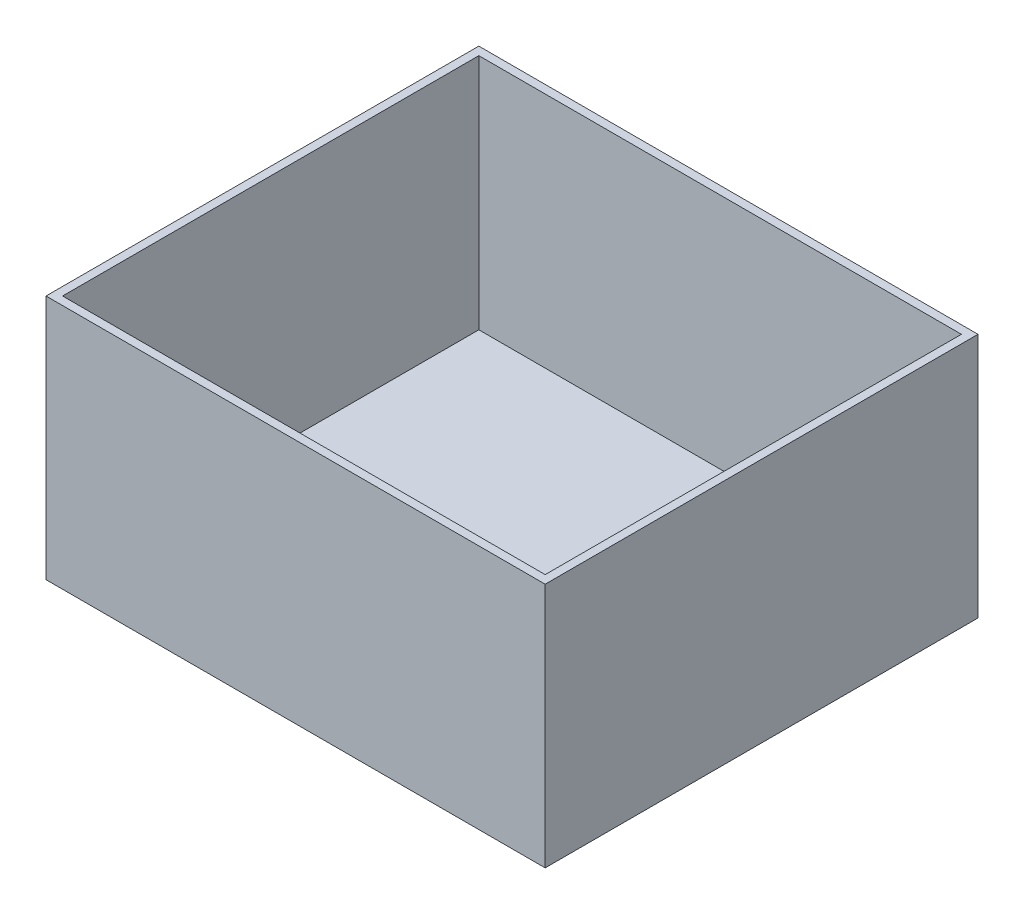
ISO-10303-21;
HEADER;
FILE_DESCRIPTION(('STEP AP214'),'2;1');
FILE_NAME('part.step','',(''),(''),'','','');
FILE_SCHEMA(('AUTOMOTIVE_DESIGN { 1 0 10303 214 1 1 1 1 }'));
ENDSEC;
DATA;
#1=APPLICATION_CONTEXT('core data for automotive mechanical design processes');
#2=APPLICATION_PROTOCOL_DEFINITION('international standard','automotive_design',2000,#1);
#3=PRODUCT_CONTEXT('',#1,'mechanical');
#4=PRODUCT('Part','Part','',(#3));
#5=PRODUCT_RELATED_PRODUCT_CATEGORY('part','',(#4));
#6=PRODUCT_DEFINITION_FORMATION('','',#4);
#7=PRODUCT_DEFINITION_CONTEXT('part definition',#1,'design');
#8=PRODUCT_DEFINITION('design','',#6,#7);
#9=PRODUCT_DEFINITION_SHAPE('','',#8);
#10=(LENGTH_UNIT() NAMED_UNIT(*) SI_UNIT(.MILLI.,.METRE.));
#11=(NAMED_UNIT(*) PLANE_ANGLE_UNIT() SI_UNIT($,.RADIAN.));
#12=(NAMED_UNIT(*) SI_UNIT($,.STERADIAN.) SOLID_ANGLE_UNIT());
#13=UNCERTAINTY_MEASURE_WITH_UNIT(LENGTH_MEASURE(1.E-05),#10,'distance_accuracy_value','');
#14=(GEOMETRIC_REPRESENTATION_CONTEXT(3) GLOBAL_UNCERTAINTY_ASSIGNED_CONTEXT((#13)) GLOBAL_UNIT_ASSIGNED_CONTEXT((#10,
#11,#12)) REPRESENTATION_CONTEXT('',''));
#15=CARTESIAN_POINT('',(0.,0.,0.));
#16=DIRECTION('',(0.,0.,1.));
#17=DIRECTION('',(1.,0.,0.));
#18=AXIS2_PLACEMENT_3D('',#15,#16,#17);
#19=CARTESIAN_POINT('',(157.177421254665,-270.823059497379,-47.6955186951065));
#20=DIRECTION('',(0.,0.,-1.));
#21=DIRECTION('',(0.,1.,0.));
#22=AXIS2_PLACEMENT_3D('',#19,#20,#21);
#23=PLANE('',#22);
#24=DIRECTION('',(0.,1.,0.));
#25=VECTOR('',#24,1.);
#26=CARTESIAN_POINT('',(157.177421254665,-270.823059497379,-47.6955186951065));
#27=LINE('',#26,#25);
#28=CARTESIAN_POINT('',(157.177421254665,-72.1234109033121,-47.6955186951057));
#29=VERTEX_POINT('',#28);
#30=CARTESIAN_POINT('',(157.177421254665,1.95658909668813,-47.6955186951055));
#31=VERTEX_POINT('',#30);
#32=EDGE_CURVE('E120',#29,#31,#27,.T.);
#33=ORIENTED_EDGE('',*,*,#32,.F.);
#34=DIRECTION('',(1.,0.,0.));
#35=VECTOR('',#34,1.);
#36=CARTESIAN_POINT('',(6.6774212546647,-72.1234109033121,-47.6955186951057));
#37=LINE('',#36,#35);
#38=CARTESIAN_POINT('',(6.6774212546647,-72.1234109033121,-47.6955186951057));
#39=VERTEX_POINT('',#38);
#40=EDGE_CURVE('E123',#39,#29,#37,.T.);
#41=ORIENTED_EDGE('',*,*,#40,.F.);
#42=DIRECTION('',(0.,1.,0.));
#43=VECTOR('',#42,1.);
#44=CARTESIAN_POINT('',(6.6774212546647,-270.823059497379,-47.6955186951064));
#45=LINE('',#44,#43);
#46=CARTESIAN_POINT('',(6.6774212546647,1.95658909668813,-47.6955186951055));
#47=VERTEX_POINT('',#46);
#48=EDGE_CURVE('E108',#39,#47,#45,.T.);
#49=ORIENTED_EDGE('',*,*,#48,.T.);
#50=DIRECTION('',(-1.,0.,0.));
#51=VECTOR('',#50,1.);
#52=CARTESIAN_POINT('',(157.177421254665,1.95658909668813,-47.6955186951055));
#53=LINE('',#52,#51);
#54=EDGE_CURVE('E176',#31,#47,#53,.T.);
#55=ORIENTED_EDGE('',*,*,#54,.F.);
#56=EDGE_LOOP('',(#33,#41,#49,#55));
#57=FACE_BOUND('',#56,.T.);
#58=ADVANCED_FACE('F39',(#57),#23,.T.);
#59=CARTESIAN_POINT('',(6.6774212546647,-270.823059497379,-47.6955186951064));
#60=DIRECTION('',(-1.,0.,0.));
#61=DIRECTION('',(0.,0.,1.));
#62=AXIS2_PLACEMENT_3D('',#59,#60,#61);
#63=PLANE('',#62);
#64=ORIENTED_EDGE('',*,*,#48,.F.);
#65=DIRECTION('',(0.,0.,-1.));
#66=VECTOR('',#65,1.);
#67=CARTESIAN_POINT('',(6.6774212546647,-72.1234109033121,-47.6955186951057));
#68=LINE('',#67,#66);
#69=CARTESIAN_POINT('',(6.6774212546647,-72.1234109033121,82.8044813048942));
#70=VERTEX_POINT('',#69);
#71=EDGE_CURVE('E112',#70,#39,#68,.T.);
#72=ORIENTED_EDGE('',*,*,#71,.F.);
#73=DIRECTION('',(0.,1.,0.));
#74=VECTOR('',#73,1.);
#75=CARTESIAN_POINT('',(6.67742125466471,-270.82305949738,82.8044813048935));
#76=LINE('',#75,#74);
#77=CARTESIAN_POINT('',(6.67742125466471,1.95658909668767,82.8044813048945));
#78=VERTEX_POINT('',#77);
#79=EDGE_CURVE('E119',#70,#78,#76,.T.);
#80=ORIENTED_EDGE('',*,*,#79,.T.);
#81=DIRECTION('',(0.,0.,1.));
#82=VECTOR('',#81,1.);
#83=CARTESIAN_POINT('',(6.6774212546647,1.95658909668813,-47.6955186951055));
#84=LINE('',#83,#82);
#85=EDGE_CURVE('E114',#47,#78,#84,.T.);
#86=ORIENTED_EDGE('',*,*,#85,.F.);
#87=EDGE_LOOP('',(#64,#72,#80,#86));
#88=FACE_BOUND('',#87,.T.);
#89=ADVANCED_FACE('F110',(#88),#63,.T.);
#90=CARTESIAN_POINT('',(6.67742125466471,-270.82305949738,82.8044813048935));
#91=DIRECTION('',(0.,0.,1.));
#92=DIRECTION('',(0.,-1.,0.));
#93=AXIS2_PLACEMENT_3D('',#90,#91,#92);
#94=PLANE('',#93);
#95=ORIENTED_EDGE('',*,*,#79,.F.);
#96=DIRECTION('',(-1.,0.,0.));
#97=VECTOR('',#96,1.);
#98=CARTESIAN_POINT('',(6.6774212546647,-72.1234109033121,82.8044813048942));
#99=LINE('',#98,#97);
#100=CARTESIAN_POINT('',(157.177421254665,-72.1234109033121,82.8044813048942));
#101=VERTEX_POINT('',#100);
#102=EDGE_CURVE('E133',#101,#70,#99,.T.);
#103=ORIENTED_EDGE('',*,*,#102,.F.);
#104=DIRECTION('',(0.,1.,0.));
#105=VECTOR('',#104,1.);
#106=CARTESIAN_POINT('',(157.177421254665,-270.82305949738,82.8044813048935));
#107=LINE('',#106,#105);
#108=CARTESIAN_POINT('',(157.177421254665,1.95658909668767,82.8044813048945));
#109=VERTEX_POINT('',#108);
#110=EDGE_CURVE('E185',#101,#109,#107,.T.);
#111=ORIENTED_EDGE('',*,*,#110,.T.);
#112=DIRECTION('',(1.,0.,0.));
#113=VECTOR('',#112,1.);
#114=CARTESIAN_POINT('',(6.67742125466471,1.95658909668767,82.8044813048945));
#115=LINE('',#114,#113);
#116=EDGE_CURVE('E181',#78,#109,#115,.T.);
#117=ORIENTED_EDGE('',*,*,#116,.F.);
#118=EDGE_LOOP('',(#95,#103,#111,#117));
#119=FACE_BOUND('',#118,.T.);
#120=ADVANCED_FACE('F196',(#119),#94,.T.);
#121=CARTESIAN_POINT('',(157.177421254665,-270.82305949738,82.8044813048935));
#122=DIRECTION('',(1.,0.,0.));
#123=DIRECTION('',(0.,0.,-1.));
#124=AXIS2_PLACEMENT_3D('',#121,#122,#123);
#125=PLANE('',#124);
#126=ORIENTED_EDGE('',*,*,#110,.F.);
#127=DIRECTION('',(0.,0.,1.));
#128=VECTOR('',#127,1.);
#129=CARTESIAN_POINT('',(157.177421254665,-72.1234109033121,-47.6955186951057));
#130=LINE('',#129,#128);
#131=EDGE_CURVE('E128',#29,#101,#130,.T.);
#132=ORIENTED_EDGE('',*,*,#131,.F.);
#133=ORIENTED_EDGE('',*,*,#32,.T.);
#134=DIRECTION('',(0.,0.,-1.));
#135=VECTOR('',#134,1.);
#136=CARTESIAN_POINT('',(157.177421254665,1.95658909668767,82.8044813048945));
#137=LINE('',#136,#135);
#138=EDGE_CURVE('E164',#109,#31,#137,.T.);
#139=ORIENTED_EDGE('',*,*,#138,.F.);
#140=EDGE_LOOP('',(#126,#132,#133,#139));
#141=FACE_BOUND('',#140,.T.);
#142=ADVANCED_FACE('F41',(#141),#125,.T.);
#143=CARTESIAN_POINT('',(0.,1.95658909668796,0.));
#144=DIRECTION('',(0.,1.,0.));
#145=DIRECTION('',(0.,0.,1.));
#146=AXIS2_PLACEMENT_3D('',#143,#144,#145);
#147=PLANE('',#146);
#148=DIRECTION('',(0.,0.,1.));
#149=VECTOR('',#148,1.);
#150=CARTESIAN_POINT('',(9.17742125466471,1.95658909668812,-45.1955186951055));
#151=LINE('',#150,#149);
#152=CARTESIAN_POINT('',(9.17742125466471,1.95658909668812,-45.1955186951055));
#153=VERTEX_POINT('',#152);
#154=CARTESIAN_POINT('',(9.17742125466471,1.95658909668768,80.3044813048945));
#155=VERTEX_POINT('',#154);
#156=EDGE_CURVE('E140',#153,#155,#151,.T.);
#157=ORIENTED_EDGE('',*,*,#156,.F.);
#158=DIRECTION('',(-1.,0.,0.));
#159=VECTOR('',#158,1.);
#160=CARTESIAN_POINT('',(154.677421254665,1.95658909668812,-45.1955186951055));
#161=LINE('',#160,#159);
#162=CARTESIAN_POINT('',(154.677421254665,1.95658909668812,-45.1955186951055));
#163=VERTEX_POINT('',#162);
#164=EDGE_CURVE('E157',#163,#153,#161,.T.);
#165=ORIENTED_EDGE('',*,*,#164,.F.);
#166=DIRECTION('',(0.,0.,-1.));
#167=VECTOR('',#166,1.);
#168=CARTESIAN_POINT('',(154.677421254665,1.95658909668768,80.3044813048945));
#169=LINE('',#168,#167);
#170=CARTESIAN_POINT('',(154.677421254665,1.95658909668768,80.3044813048945));
#171=VERTEX_POINT('',#170);
#172=EDGE_CURVE('E153',#171,#163,#169,.T.);
#173=ORIENTED_EDGE('',*,*,#172,.F.);
#174=DIRECTION('',(1.,0.,0.));
#175=VECTOR('',#174,1.);
#176=CARTESIAN_POINT('',(9.17742125466471,1.95658909668768,80.3044813048945));
#177=LINE('',#176,#175);
#178=EDGE_CURVE('E150',#155,#171,#177,.T.);
#179=ORIENTED_EDGE('',*,*,#178,.F.);
#180=EDGE_LOOP('',(#157,#165,#173,#179));
#181=FACE_BOUND('',#180,.T.);
#182=ORIENTED_EDGE('',*,*,#138,.T.);
#183=ORIENTED_EDGE('',*,*,#54,.T.);
#184=ORIENTED_EDGE('',*,*,#85,.T.);
#185=ORIENTED_EDGE('',*,*,#116,.T.);
#186=EDGE_LOOP('',(#182,#183,#184,#185));
#187=FACE_BOUND('',#186,.T.);
#188=ADVANCED_FACE('F193',(#181,#187),#147,.T.);
#189=CARTESIAN_POINT('',(9.17742125466471,-270.82305949738,80.3044813048935));
#190=DIRECTION('',(0.,0.,1.));
#191=DIRECTION('',(0.,-1.,0.));
#192=AXIS2_PLACEMENT_3D('',#189,#190,#191);
#193=PLANE('',#192);
#194=DIRECTION('',(0.,1.,0.));
#195=VECTOR('',#194,1.);
#196=CARTESIAN_POINT('',(154.677421254665,-270.82305949738,80.3044813048935));
#197=LINE('',#196,#195);
#198=CARTESIAN_POINT('',(154.677421254665,-69.6234109033121,80.3044813048942));
#199=VERTEX_POINT('',#198);
#200=EDGE_CURVE('E168',#199,#171,#197,.T.);
#201=ORIENTED_EDGE('',*,*,#200,.F.);
#202=DIRECTION('',(-1.,0.,0.));
#203=VECTOR('',#202,1.);
#204=CARTESIAN_POINT('',(9.17742125466471,-69.6234109033121,80.3044813048942));
#205=LINE('',#204,#203);
#206=CARTESIAN_POINT('',(9.17742125466471,-69.6234109033121,80.3044813048942));
#207=VERTEX_POINT('',#206);
#208=EDGE_CURVE('E43',#199,#207,#205,.T.);
#209=ORIENTED_EDGE('',*,*,#208,.T.);
#210=DIRECTION('',(0.,1.,0.));
#211=VECTOR('',#210,1.);
#212=CARTESIAN_POINT('',(9.17742125466471,-270.82305949738,80.3044813048935));
#213=LINE('',#212,#211);
#214=EDGE_CURVE('E64',#207,#155,#213,.T.);
#215=ORIENTED_EDGE('',*,*,#214,.T.);
#216=ORIENTED_EDGE('',*,*,#178,.T.);
#217=EDGE_LOOP('',(#201,#209,#215,#216));
#218=FACE_BOUND('',#217,.T.);
#219=ADVANCED_FACE('F233',(#218),#193,.F.);
#220=CARTESIAN_POINT('',(154.677421254665,-270.82305949738,80.3044813048935));
#221=DIRECTION('',(1.,0.,0.));
#222=DIRECTION('',(0.,0.,-1.));
#223=AXIS2_PLACEMENT_3D('',#220,#221,#222);
#224=PLANE('',#223);
#225=DIRECTION('',(0.,1.,0.));
#226=VECTOR('',#225,1.);
#227=CARTESIAN_POINT('',(154.677421254665,-270.823059497379,-45.1955186951065));
#228=LINE('',#227,#226);
#229=CARTESIAN_POINT('',(154.677421254665,-69.6234109033121,-45.1955186951065));
#230=VERTEX_POINT('',#229);
#231=EDGE_CURVE('E165',#230,#163,#228,.T.);
#232=ORIENTED_EDGE('',*,*,#231,.F.);
#233=DIRECTION('',(0.,0.,1.));
#234=VECTOR('',#233,1.);
#235=CARTESIAN_POINT('',(154.677421254665,-69.6234109033121,80.3044813048935));
#236=LINE('',#235,#234);
#237=EDGE_CURVE('E11',#230,#199,#236,.T.);
#238=ORIENTED_EDGE('',*,*,#237,.T.);
#239=ORIENTED_EDGE('',*,*,#200,.T.);
#240=ORIENTED_EDGE('',*,*,#172,.T.);
#241=EDGE_LOOP('',(#232,#238,#239,#240));
#242=FACE_BOUND('',#241,.T.);
#243=ADVANCED_FACE('F238',(#242),#224,.F.);
#244=CARTESIAN_POINT('',(154.677421254665,-270.823059497379,-45.1955186951065));
#245=DIRECTION('',(0.,0.,-1.));
#246=DIRECTION('',(0.,1.,0.));
#247=AXIS2_PLACEMENT_3D('',#244,#245,#246);
#248=PLANE('',#247);
#249=DIRECTION('',(0.,1.,0.));
#250=VECTOR('',#249,1.);
#251=CARTESIAN_POINT('',(9.17742125466471,-270.823059497379,-45.1955186951065));
#252=LINE('',#251,#250);
#253=CARTESIAN_POINT('',(9.17742125466473,-69.6234109033121,-45.1955186951058));
#254=VERTEX_POINT('',#253);
#255=EDGE_CURVE('E161',#254,#153,#252,.T.);
#256=ORIENTED_EDGE('',*,*,#255,.F.);
#257=DIRECTION('',(1.,0.,0.));
#258=VECTOR('',#257,1.);
#259=CARTESIAN_POINT('',(154.677421254665,-69.6234109033121,-45.1955186951058));
#260=LINE('',#259,#258);
#261=EDGE_CURVE('E49',#254,#230,#260,.T.);
#262=ORIENTED_EDGE('',*,*,#261,.T.);
#263=ORIENTED_EDGE('',*,*,#231,.T.);
#264=ORIENTED_EDGE('',*,*,#164,.T.);
#265=EDGE_LOOP('',(#256,#262,#263,#264));
#266=FACE_BOUND('',#265,.T.);
#267=ADVANCED_FACE('F248',(#266),#248,.F.);
#268=CARTESIAN_POINT('',(9.17742125466471,-270.823059497379,-45.1955186951065));
#269=DIRECTION('',(-1.,0.,0.));
#270=DIRECTION('',(0.,0.,1.));
#271=AXIS2_PLACEMENT_3D('',#268,#269,#270);
#272=PLANE('',#271);
#273=ORIENTED_EDGE('',*,*,#214,.F.);
#274=DIRECTION('',(0.,0.,-1.));
#275=VECTOR('',#274,1.);
#276=CARTESIAN_POINT('',(9.17742125466471,-69.6234109033121,-45.1955186951065));
#277=LINE('',#276,#275);
#278=EDGE_CURVE('E144',#207,#254,#277,.T.);
#279=ORIENTED_EDGE('',*,*,#278,.T.);
#280=ORIENTED_EDGE('',*,*,#255,.T.);
#281=ORIENTED_EDGE('',*,*,#156,.T.);
#282=EDGE_LOOP('',(#273,#279,#280,#281));
#283=FACE_BOUND('',#282,.T.);
#284=ADVANCED_FACE('F258',(#283),#272,.F.);
#285=CARTESIAN_POINT('',(0.,-69.6234109033121,0.));
#286=DIRECTION('',(0.,1.,0.));
#287=DIRECTION('',(0.,0.,1.));
#288=AXIS2_PLACEMENT_3D('',#285,#286,#287);
#289=PLANE('',#288);
#290=ORIENTED_EDGE('',*,*,#208,.F.);
#291=ORIENTED_EDGE('',*,*,#237,.F.);
#292=ORIENTED_EDGE('',*,*,#261,.F.);
#293=ORIENTED_EDGE('',*,*,#278,.F.);
#294=EDGE_LOOP('',(#290,#291,#292,#293));
#295=FACE_BOUND('',#294,.T.);
#296=ADVANCED_FACE('F268',(#295),#289,.T.);
#297=CARTESIAN_POINT('',(0.,-72.1234109033121,0.));
#298=DIRECTION('',(0.,1.,0.));
#299=DIRECTION('',(0.,0.,1.));
#300=AXIS2_PLACEMENT_3D('',#297,#298,#299);
#301=PLANE('',#300);
#302=ORIENTED_EDGE('',*,*,#71,.T.);
#303=ORIENTED_EDGE('',*,*,#40,.T.);
#304=ORIENTED_EDGE('',*,*,#131,.T.);
#305=ORIENTED_EDGE('',*,*,#102,.T.);
#306=EDGE_LOOP('',(#302,#303,#304,#305));
#307=FACE_BOUND('',#306,.T.);
#308=ADVANCED_FACE('F131',(#307),#301,.F.);
#309=CLOSED_SHELL('',(#58,#89,#120,#142,#188,#219,#243,#267,#284,#296,#308));
#310=MANIFOLD_SOLID_BREP('B2',#309);
#311=ADVANCED_BREP_SHAPE_REPRESENTATION('',(#18,#310),#14);
#312=SHAPE_DEFINITION_REPRESENTATION(#9,#311);
ENDSEC;
END-ISO-10303-21;
